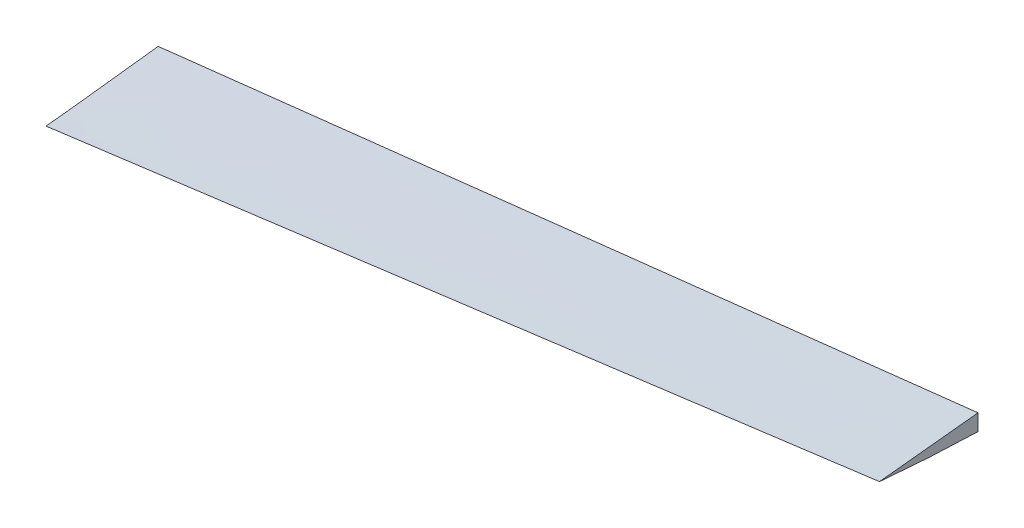
ISO-10303-21;
HEADER;
FILE_DESCRIPTION(('STEP AP214'),'2;1');
FILE_NAME('part.step','',(''),(''),'','','');
FILE_SCHEMA(('AUTOMOTIVE_DESIGN { 1 0 10303 214 1 1 1 1 }'));
ENDSEC;
DATA;
#1=APPLICATION_CONTEXT('core data for automotive mechanical design processes');
#2=APPLICATION_PROTOCOL_DEFINITION('international standard','automotive_design',2000,#1);
#3=PRODUCT_CONTEXT('',#1,'mechanical');
#4=PRODUCT('Part','Part','',(#3));
#5=PRODUCT_RELATED_PRODUCT_CATEGORY('part','',(#4));
#6=PRODUCT_DEFINITION_FORMATION('','',#4);
#7=PRODUCT_DEFINITION_CONTEXT('part definition',#1,'design');
#8=PRODUCT_DEFINITION('design','',#6,#7);
#9=PRODUCT_DEFINITION_SHAPE('','',#8);
#10=(LENGTH_UNIT() NAMED_UNIT(*) SI_UNIT(.MILLI.,.METRE.));
#11=(NAMED_UNIT(*) PLANE_ANGLE_UNIT() SI_UNIT($,.RADIAN.));
#12=(NAMED_UNIT(*) SI_UNIT($,.STERADIAN.) SOLID_ANGLE_UNIT());
#13=UNCERTAINTY_MEASURE_WITH_UNIT(LENGTH_MEASURE(1.E-05),#10,'distance_accuracy_value','');
#14=(GEOMETRIC_REPRESENTATION_CONTEXT(3) GLOBAL_UNCERTAINTY_ASSIGNED_CONTEXT((#13)) GLOBAL_UNIT_ASSIGNED_CONTEXT((#10,
#11,#12)) REPRESENTATION_CONTEXT('',''));
#15=CARTESIAN_POINT('',(0.,0.,0.));
#16=DIRECTION('',(0.,0.,1.));
#17=DIRECTION('',(1.,0.,0.));
#18=AXIS2_PLACEMENT_3D('',#15,#16,#17);
#19=CARTESIAN_POINT('',(2447.30235188464,-209.311409679221,0.));
#20=DIRECTION('',(-1.,0.,0.));
#21=DIRECTION('',(0.,0.,1.));
#22=AXIS2_PLACEMENT_3D('',#19,#20,#21);
#23=PLANE('',#22);
#24=DIRECTION('',(0.,1.,0.));
#25=VECTOR('',#24,1.);
#26=CARTESIAN_POINT('',(2447.30235188464,-209.311409679221,711.903406011324));
#27=LINE('',#26,#25);
#28=CARTESIAN_POINT('',(2447.30235188464,127.230999408886,711.903406011324));
#29=VERTEX_POINT('',#28);
#30=CARTESIAN_POINT('',(2447.30235188464,154.239299038269,711.903406011324));
#31=VERTEX_POINT('',#30);
#32=EDGE_CURVE('E93',#29,#31,#27,.T.);
#33=ORIENTED_EDGE('',*,*,#32,.T.);
#34=CARTESIAN_POINT('',(2447.30235188464,154.239299038269,711.903406011324));
#35=CARTESIAN_POINT('',(2447.30235188464,153.901181779624,715.300913346903));
#36=CARTESIAN_POINT('',(2447.30235188464,153.560697013205,718.698184748369));
#37=CARTESIAN_POINT('',(2447.30235188464,152.875208153736,725.492271074562));
#38=CARTESIAN_POINT('',(2447.30235188464,152.530204061408,728.889085999362));
#39=CARTESIAN_POINT('',(2447.30235188464,151.83589413983,735.682256193434));
#40=CARTESIAN_POINT('',(2447.30235188464,151.486588335484,739.07861146525));
#41=CARTESIAN_POINT('',(2447.30235188464,150.783887441312,745.870898805664));
#42=CARTESIAN_POINT('',(2447.30235188464,150.430492351552,749.266830874268));
#43=CARTESIAN_POINT('',(2447.30235188464,149.719890590803,756.05829659947));
#44=CARTESIAN_POINT('',(2447.30235188464,149.362683919243,759.453830256008));
#45=CARTESIAN_POINT('',(2447.30235188464,148.644763541648,766.244526482214));
#46=CARTESIAN_POINT('',(2447.30235188464,148.284049835828,769.639689051906));
#47=CARTESIAN_POINT('',(2447.30235188464,147.559439890166,776.42968748534));
#48=CARTESIAN_POINT('',(2447.30235188464,147.195543638244,779.824523347794));
#49=CARTESIAN_POINT('',(2447.30235188464,146.464928478762,786.613892000002));
#50=CARTESIAN_POINT('',(2447.30235188464,146.098209570571,790.008424789688));
#51=CARTESIAN_POINT('',(2447.30235188464,145.484995007267,795.665762302538));
#52=CARTESIAN_POINT('',(2447.30235188464,145.239171423317,797.928639918983));
#53=CARTESIAN_POINT('',(2447.30235188464,144.746585058713,802.454292305212));
#54=CARTESIAN_POINT('',(2447.30235188464,144.499822278312,804.717067075023));
#55=CARTESIAN_POINT('',(2447.30235188464,144.005499218229,809.242527221412));
#56=CARTESIAN_POINT('',(2447.30235188464,143.757938939336,811.505212598075));
#57=CARTESIAN_POINT('',(2447.30235188464,143.262210651827,816.030518986471));
#58=CARTESIAN_POINT('',(2447.30235188464,143.014042642618,818.293139998139));
#59=CARTESIAN_POINT('',(2447.30235188464,142.517605468776,822.818373235184));
#60=CARTESIAN_POINT('',(2447.30235188464,142.26933630404,825.08098546055));
#61=CARTESIAN_POINT('',(2447.30235188464,141.773257232358,829.606269170652));
#62=CARTESIAN_POINT('',(2447.30235188464,141.525447327192,831.868940655584));
#63=CARTESIAN_POINT('',(2447.30235188464,141.030956035476,836.394404059674));
#64=CARTESIAN_POINT('',(2447.30235188464,140.784274647464,838.657195978673));
#65=CARTESIAN_POINT('',(2447.30235188464,140.292814912716,843.182979270085));
#66=CARTESIAN_POINT('',(2447.30235188464,140.048036559707,845.445970641815));
#67=CARTESIAN_POINT('',(2447.30235188464,139.683052601572,848.840680292605));
#68=CARTESIAN_POINT('',(2447.30235188464,139.561755854132,849.972281217774));
#69=CARTESIAN_POINT('',(2447.30235188464,139.320272257106,852.235600408934));
#70=CARTESIAN_POINT('',(2447.30235188464,139.200085406301,853.367318674794));
#71=CARTESIAN_POINT('',(2447.30235188464,139.001026715525,855.253683424999));
#72=CARTESIAN_POINT('',(2447.30235188464,138.921736099067,856.008285705963));
#73=CARTESIAN_POINT('',(2447.30235188464,138.763962735591,857.517575577193));
#74=CARTESIAN_POINT('',(2447.30235188464,138.68547998943,858.272263167548));
#75=CARTESIAN_POINT('',(2447.30235188464,138.529448206426,859.781738039569));
#76=CARTESIAN_POINT('',(2447.30235188464,138.451899173394,860.536525321629));
#77=CARTESIAN_POINT('',(2447.30235188464,138.297971037103,862.04622383827));
#78=CARTESIAN_POINT('',(2447.30235188464,138.221591940745,862.801135073556));
#79=CARTESIAN_POINT('',(2447.30235188464,138.07038341548,864.311110545028));
#80=CARTESIAN_POINT('',(2447.30235188464,137.995553981595,865.066174780713));
#81=CARTESIAN_POINT('',(2447.30235188464,137.847824309025,866.57648470934));
#82=CARTESIAN_POINT('',(2447.30235188464,137.774924051188,867.331730400405));
#83=CARTESIAN_POINT('',(2447.30235188464,137.631513003727,868.842509611029));
#84=CARTESIAN_POINT('',(2447.30235188464,137.561002403801,869.598043148647));
#85=CARTESIAN_POINT('',(2447.30235188464,137.424111748015,871.10949336672));
#86=CARTESIAN_POINT('',(2447.30235188464,137.357731710373,871.865410048851));
#87=CARTESIAN_POINT('',(2447.30235188464,137.231052694076,873.377787656102));
#88=CARTESIAN_POINT('',(2447.30235188464,137.170754015199,874.134248606203));
#89=CARTESIAN_POINT('',(2447.30235188464,137.114474518952,874.891026670315));
#90=B_SPLINE_CURVE_WITH_KNOTS('',3,(#34,#35,#36,#37,#38,#39,#40,#41,#42,#43,#44,#45,#46,#47,#48,
#49,#50,#51,#52,#53,#54,#55,#56,#57,#58,#59,#60,#61,#62,#63,#64,#65,#66,#67,#68,#69,#70,#71,#72,
#73,#74,#75,#76,#77,#78,#79,#80,#81,#82,#83,#84,#85,#86,#87,#88,#89),.UNSPECIFIED.,.F.,.F.,(4,2,
2,2,2,2,2,2,2,2,2,2,2,2,2,2,2,2,2,2,2,2,2,2,2,2,2,4),(0.,10.2428700961824,20.4857385573688,
30.7285477466414,40.9713567699184,51.2141673313228,61.4569772600907,71.6998260802671,
81.9426771908076,88.7712492553256,95.5998194833511,102.428382969072,109.256953127467,
116.085530221921,122.914133746585,129.74272842498,136.571300586764,139.985550119495,
143.399795904441,145.676065405756,147.952337319778,150.228618519277,152.504913140212,
154.781200445441,157.057465143699,159.333910118316,161.610365132609,163.886932308512),.UNSPECIFIED.);
#91=CARTESIAN_POINT('',(2447.30235188464,137.114474518952,874.891026670315));
#92=VERTEX_POINT('',#91);
#93=EDGE_CURVE('E63',#31,#92,#90,.T.);
#94=ORIENTED_EDGE('',*,*,#93,.T.);
#95=CARTESIAN_POINT('',(2447.30235188464,137.114474518952,874.891026670315));
#96=CARTESIAN_POINT('',(2447.30235188464,136.639872891949,870.377378796616));
#97=CARTESIAN_POINT('',(2447.30235188464,136.19415341231,865.860797787376));
#98=CARTESIAN_POINT('',(2447.30235188464,135.351355932978,856.824292419796));
#99=CARTESIAN_POINT('',(2447.30235188464,134.954265052625,852.304369267224));
#100=CARTESIAN_POINT('',(2447.30235188464,134.388113551594,845.522399653365));
#101=CARTESIAN_POINT('',(2447.30235188464,134.204322814793,843.26156012022));
#102=CARTESIAN_POINT('',(2447.30235188464,133.845888350278,838.739155071906));
#103=CARTESIAN_POINT('',(2447.30235188464,133.671244614875,836.477589557347));
#104=CARTESIAN_POINT('',(2447.30235188464,133.33051342653,831.953992948197));
#105=CARTESIAN_POINT('',(2447.30235188464,133.164425308397,829.691961903571));
#106=CARTESIAN_POINT('',(2447.30235188464,132.840175326328,825.167331629552));
#107=CARTESIAN_POINT('',(2447.30235188464,132.682013464545,822.904732400004));
#108=CARTESIAN_POINT('',(2447.30235188464,132.373003457026,818.379113734275));
#109=CARTESIAN_POINT('',(2447.30235188464,132.222155059211,816.116094315279));
#110=CARTESIAN_POINT('',(2447.30235188464,131.927168725874,811.589618779598));
#111=CARTESIAN_POINT('',(2447.30235188464,131.783030789897,809.326162662943));
#112=CARTESIAN_POINT('',(2447.30235188464,131.501165052961,804.798866222598));
#113=CARTESIAN_POINT('',(2447.30235188464,131.363437210369,802.5350259015));
#114=CARTESIAN_POINT('',(2447.30235188464,131.094108814533,798.006981615386));
#115=CARTESIAN_POINT('',(2447.30235188464,130.96250826105,795.742777650384));
#116=CARTESIAN_POINT('',(2447.30235188464,130.576494237199,788.950135589921));
#117=CARTESIAN_POINT('',(2447.30235188464,130.330839277449,784.421197592704));
#118=CARTESIAN_POINT('',(2447.30235188464,129.860592542894,775.361990784688));
#119=CARTESIAN_POINT('',(2447.30235188464,129.636001898575,770.831721915537));
#120=CARTESIAN_POINT('',(2447.30235188464,129.205587132529,761.76995109744));
#121=CARTESIAN_POINT('',(2447.30235188464,128.999764435091,757.238449081042));
#122=CARTESIAN_POINT('',(2447.30235188464,128.60462932428,748.174310782504));
#123=CARTESIAN_POINT('',(2447.30235188464,128.415318428576,743.641674434421));
#124=CARTESIAN_POINT('',(2447.30235188464,128.051873882362,734.575324607503));
#125=CARTESIAN_POINT('',(2447.30235188464,127.87774180532,730.041611065734));
#126=CARTESIAN_POINT('',(2447.30235188464,127.543818128726,720.973142152714));
#127=CARTESIAN_POINT('',(2447.30235188464,127.384028152814,716.438386721626));
#128=CARTESIAN_POINT('',(2447.30235188464,127.230999408886,711.903406011324));
#129=B_SPLINE_CURVE_WITH_KNOTS('',3,(#95,#96,#97,#98,#99,#100,#101,#102,#103,#104,#105,#106,
#107,#108,#109,#110,#111,#112,#113,#114,#115,#116,#117,#118,#119,#120,#121,#122,#123,#124,#125,
#126,#127,#128),.UNSPECIFIED.,.F.,.F.,(4,2,2,2,2,2,2,2,2,2,2,2,2,2,2,2,4),(0.,13.6153577778901,
27.2271013061145,34.0319834304496,40.8368598351166,47.6412063649103,54.4455547418496,
61.2496684215841,68.0537816398139,74.8578506586981,81.6619194116441,95.2686450199802,
108.876100460938,122.484587706083,136.094324449355,149.705470332978,163.318155168481),.UNSPECIFIED.);
#130=EDGE_CURVE('E11',#92,#29,#129,.T.);
#131=ORIENTED_EDGE('',*,*,#130,.T.);
#132=EDGE_LOOP('',(#33,#94,#131));
#133=FACE_BOUND('',#132,.T.);
#134=ADVANCED_FACE('F40',(#133),#23,.F.);
#135=CARTESIAN_POINT('',(1114.11611207478,-209.311409679221,0.));
#136=DIRECTION('',(1.,0.,0.));
#137=DIRECTION('',(0.,0.,-1.));
#138=AXIS2_PLACEMENT_3D('',#135,#136,#137);
#139=PLANE('',#138);
#140=CARTESIAN_POINT('',(1114.11611207478,-8.63764988127563,734.977783238803));
#141=CARTESIAN_POINT('',(1114.11611207478,-8.45957680059779,740.140867407803));
#142=CARTESIAN_POINT('',(1114.11611207478,-8.27384156909683,745.303690989605));
#143=CARTESIAN_POINT('',(1114.11611207478,-7.88603952665465,755.628147128611));
#144=CARTESIAN_POINT('',(1114.11611207478,-7.68397454091832,760.789779754435));
#145=CARTESIAN_POINT('',(1114.11611207478,-7.2624879328826,771.111809893384));
#146=CARTESIAN_POINT('',(1114.11611207478,-7.04306808444751,776.272207478804));
#147=CARTESIAN_POINT('',(1114.11611207478,-6.58574496202071,786.591718494241));
#148=CARTESIAN_POINT('',(1114.11611207478,-6.34784336094807,791.750831998178));
#149=CARTESIAN_POINT('',(1114.11611207478,-5.85090350628906,802.067657300268));
#150=CARTESIAN_POINT('',(1114.11611207478,-5.59186683482196,807.225369174398));
#151=CARTESIAN_POINT('',(1114.11611207478,-5.05003008571934,817.539277400215));
#152=CARTESIAN_POINT('',(1114.11611207478,-4.76723126801575,822.695473817727));
#153=CARTESIAN_POINT('',(1114.11611207478,-4.32321863057361,830.428891671589));
#154=CARTESIAN_POINT('',(1114.11611207478,-4.17190373691903,833.006683849249));
#155=CARTESIAN_POINT('',(1114.11611207478,-3.86233762434715,838.161852645245));
#156=CARTESIAN_POINT('',(1114.11611207478,-3.70408640493553,840.739229263551));
#157=CARTESIAN_POINT('',(1114.11611207478,-3.38034661771321,845.893543775042));
#158=CARTESIAN_POINT('',(1114.11611207478,-3.21485800612087,848.470481665478));
#159=CARTESIAN_POINT('',(1114.11611207478,-2.87617527097871,853.623851621502));
#160=CARTESIAN_POINT('',(1114.11611207478,-2.70298114757655,856.200283687099));
#161=CARTESIAN_POINT('',(1114.11611207478,-2.34822180972922,861.352659341887));
#162=CARTESIAN_POINT('',(1114.11611207478,-2.16665631344067,863.928602911696));
#163=CARTESIAN_POINT('',(1114.11611207478,-1.79454106721705,869.079841452327));
#164=CARTESIAN_POINT('',(1114.11611207478,-1.60399131849819,871.655136423237));
#165=CARTESIAN_POINT('',(1114.11611207478,-1.21324637770925,876.805195223314));
#166=CARTESIAN_POINT('',(1114.11611207478,-1.01305044210288,879.379958996125));
#167=CARTESIAN_POINT('',(1114.11611207478,-0.602452213075745,884.528675225407));
#168=CARTESIAN_POINT('',(1114.11611207478,-0.392049912883171,887.102627681341));
#169=CARTESIAN_POINT('',(1114.11611207478,0.0399053870041297,892.249980592457));
#170=CARTESIAN_POINT('',(1114.11611207478,0.261460025855485,894.823380910338));
#171=CARTESIAN_POINT('',(1114.11611207478,0.716924397678878,899.969084353498));
#172=CARTESIAN_POINT('',(1114.11611207478,0.950834105208194,902.541387481027));
#173=CARTESIAN_POINT('',(1114.11611207478,1.43224495779536,907.685393098714));
#174=CARTESIAN_POINT('',(1114.11611207478,1.67974958885108,910.257095263405));
#175=CARTESIAN_POINT('',(1114.11611207478,2.18948396280929,915.399057131923));
#176=CARTESIAN_POINT('',(1114.11611207478,2.45171381019733,917.969316825384));
#177=CARTESIAN_POINT('',(1114.11611207478,2.72189887523852,920.538747710713));
#178=B_SPLINE_CURVE_WITH_KNOTS('',3,(#140,#141,#142,#143,#144,#145,#146,#147,#148,#149,#150,
#151,#152,#153,#154,#155,#156,#157,#158,#159,#160,#161,#162,#163,#164,#165,#166,#167,#168,#169,
#170,#171,#172,#173,#174,#175,#176,#177),.UNSPECIFIED.,.F.,.F.,(4,2,2,2,2,2,2,2,2,2,2,2,2,2,2,2,
2,2,4),(0.,15.4984621085891,30.995194316797,46.4903446245951,61.9840939831939,77.476684580151,
92.9684542366647,100.715134737937,108.46181579128,116.208543713605,123.955271487474,
131.702260265196,139.449247994211,147.196833825895,154.944424798089,162.693157845461,
170.441874936532,178.192588307248,185.943356681569),.UNSPECIFIED.);
#179=CARTESIAN_POINT('',(1114.11611207478,-8.63764988127572,734.977783238803));
#180=VERTEX_POINT('',#179);
#181=CARTESIAN_POINT('',(1114.11611207478,2.72189887523844,920.538747710712));
#182=VERTEX_POINT('',#181);
#183=EDGE_CURVE('E56',#180,#182,#178,.T.);
#184=ORIENTED_EDGE('',*,*,#183,.T.);
#185=CARTESIAN_POINT('',(1114.11611207478,2.72189887523844,920.538747710712));
#186=CARTESIAN_POINT('',(1114.11611207478,2.78312712053246,919.675808987865));
#187=CARTESIAN_POINT('',(1114.11611207478,2.84833933481407,918.813163786098));
#188=CARTESIAN_POINT('',(1114.11611207478,2.98550145564108,917.08845710322));
#189=CARTESIAN_POINT('',(1114.11611207478,3.0574509777439,916.226395591626));
#190=CARTESIAN_POINT('',(1114.11611207478,3.206863927746,914.502763830938));
#191=CARTESIAN_POINT('',(1114.11611207478,3.28432729630843,913.641193576657));
#192=CARTESIAN_POINT('',(1114.11611207478,3.44354508594008,911.918514037923));
#193=CARTESIAN_POINT('',(1114.11611207478,3.5252991962434,911.057404724636));
#194=CARTESIAN_POINT('',(1114.11611207478,3.65024979635369,909.765960707129));
#195=CARTESIAN_POINT('',(1114.11611207478,3.69228686797917,909.335513046527));
#196=CARTESIAN_POINT('',(1114.11611207478,3.77697796287327,908.474678399423));
#197=CARTESIAN_POINT('',(1114.11611207478,3.81963198611025,908.044291412918));
#198=CARTESIAN_POINT('',(1114.11611207478,3.94845911654393,906.753213384666));
#199=CARTESIAN_POINT('',(1114.11611207478,4.03549696341548,905.892608581312));
#200=CARTESIAN_POINT('',(1114.11611207478,4.25562058753378,903.741650547325));
#201=CARTESIAN_POINT('',(1114.11611207478,4.38998476781105,902.451428195505));
#202=CARTESIAN_POINT('',(1114.11611207478,4.66245055930781,899.871386143646));
#203=CARTESIAN_POINT('',(1114.11611207478,4.80055215097003,898.581566441537));
#204=CARTESIAN_POINT('',(1114.11611207478,5.07957147422909,896.002203352579));
#205=CARTESIAN_POINT('',(1114.11611207478,5.22048926792021,894.712659972459));
#206=CARTESIAN_POINT('',(1114.11611207478,5.50467808657557,892.133830833562));
#207=CARTESIAN_POINT('',(1114.11611207478,5.64794911496829,890.844545075162));
#208=CARTESIAN_POINT('',(1114.11611207478,5.93654966160471,888.266227115696));
#209=CARTESIAN_POINT('',(1114.11611207478,6.08187914356752,886.977194910565));
#210=CARTESIAN_POINT('',(1114.11611207478,6.37426598785064,884.399327207519));
#211=CARTESIAN_POINT('',(1114.11611207478,6.52132334940311,883.110491709518));
#212=CARTESIAN_POINT('',(1114.11611207478,6.81685376436571,880.53299298608));
#213=CARTESIAN_POINT('',(1114.11611207478,6.96532680711073,879.24432975942));
#214=CARTESIAN_POINT('',(1114.11611207478,7.26334587121772,876.667127281831));
#215=CARTESIAN_POINT('',(1114.11611207478,7.41289189272755,875.37858803092));
#216=CARTESIAN_POINT('',(1114.11611207478,7.71289160211865,872.801600338109));
#217=CARTESIAN_POINT('',(1114.11611207478,7.86334530031796,871.51315189741));
#218=CARTESIAN_POINT('',(1114.11611207478,8.16509636867343,868.936353920824));
#219=CARTESIAN_POINT('',(1114.11611207478,8.31639373877555,867.64800438493));
#220=CARTESIAN_POINT('',(1114.11611207478,8.77142341020872,863.783084506679));
#221=CARTESIAN_POINT('',(1114.11611207478,9.07629267801341,861.206647996305));
#222=CARTESIAN_POINT('',(1114.11611207478,9.68842836914048,856.054040788956));
#223=CARTESIAN_POINT('',(1114.11611207478,9.99569481011644,853.477870094081));
#224=CARTESIAN_POINT('',(1114.11611207478,10.6119877472548,848.325740812713));
#225=CARTESIAN_POINT('',(1114.11611207478,10.9210142424399,845.749782226103));
#226=CARTESIAN_POINT('',(1114.11611207478,11.5402074766053,840.597994569352));
#227=CARTESIAN_POINT('',(1114.11611207478,11.8503742189122,838.02216549961));
#228=CARTESIAN_POINT('',(1114.11611207478,12.4712138713706,832.87056801963));
#229=CARTESIAN_POINT('',(1114.11611207478,12.7818867815954,830.2947996094));
#230=CARTESIAN_POINT('',(1114.11611207478,13.4031739716276,825.14335068187));
#231=CARTESIAN_POINT('',(1114.11611207478,13.7137882531552,822.567670164778));
#232=CARTESIAN_POINT('',(1114.11611207478,14.3348524199862,817.416289423255));
#233=CARTESIAN_POINT('',(1114.11611207478,14.6453023052965,814.840589198825));
#234=CARTESIAN_POINT('',(1114.11611207478,15.576169969008,807.113408571135));
#235=CARTESIAN_POINT('',(1114.11611207478,16.1961031550658,801.961869751738));
#236=CARTESIAN_POINT('',(1114.11611207478,17.4335008948234,791.658474294146));
#237=CARTESIAN_POINT('',(1114.11611207478,18.0509654385243,786.506617654749));
#238=CARTESIAN_POINT('',(1114.11611207478,19.2822607027744,776.20244764566));
#239=CARTESIAN_POINT('',(1114.11611207478,19.8960914078237,771.050134274115));
#240=CARTESIAN_POINT('',(1114.11611207478,21.1189616871359,760.744912575504));
#241=CARTESIAN_POINT('',(1114.11611207478,21.7280012376457,755.592004245617));
#242=CARTESIAN_POINT('',(1114.11611207478,22.9401822307826,745.285461430918));
#243=CARTESIAN_POINT('',(1114.11611207478,23.5433236364968,740.131826941766));
#244=CARTESIAN_POINT('',(1114.11611207478,24.1429602001476,734.977783238803));
#245=B_SPLINE_CURVE_WITH_KNOTS('',3,(#185,#186,#187,#188,#189,#190,#191,#192,#193,#194,#195,
#196,#197,#198,#199,#200,#201,#202,#203,#204,#205,#206,#207,#208,#209,#210,#211,#212,#213,#214,
#215,#216,#217,#218,#219,#220,#221,#222,#223,#224,#225,#226,#227,#228,#229,#230,#231,#232,#233,
#234,#235,#236,#237,#238,#239,#240,#241,#242,#243,#244),.UNSPECIFIED.,.F.,.F.,(4,2,2,2,2,2,2,2,
2,2,2,2,2,2,2,2,2,2,2,2,2,2,2,2,2,2,2,2,2,4),(0.,2.59529973633038,5.19045147045508,
7.7855752812601,10.3805113935087,11.677997420431,12.9754833808229,15.5704652695947,
19.4620575174721,23.3536294052083,27.2452871928526,31.1369506508425,35.0285456022008,
38.9201388242919,42.8117027520131,46.7032672160182,50.5948760011966,54.4864845371814,
62.2697170203864,70.0530068761307,77.83629241018,85.6196006692297,93.402910057382,
101.185936599673,108.96896281175,124.535080319823,140.101260811804,155.667507652713,
171.233831617983,186.800252941338),.UNSPECIFIED.);
#246=CARTESIAN_POINT('',(1114.11611207478,24.1429602001476,734.977783238803));
#247=VERTEX_POINT('',#246);
#248=EDGE_CURVE('E96',#182,#247,#245,.T.);
#249=ORIENTED_EDGE('',*,*,#248,.T.);
#250=DIRECTION('',(0.,1.,0.));
#251=VECTOR('',#250,1.);
#252=CARTESIAN_POINT('',(1114.11611207478,-209.311409679221,734.977783238803));
#253=LINE('',#252,#251);
#254=EDGE_CURVE('E91',#180,#247,#253,.T.);
#255=ORIENTED_EDGE('',*,*,#254,.F.);
#256=EDGE_LOOP('',(#184,#249,#255));
#257=FACE_BOUND('',#256,.T.);
#258=ADVANCED_FACE('F95',(#257),#139,.F.);
#259=CARTESIAN_POINT('',(13.0506003402666,-209.311409679221,754.034686326515));
#260=DIRECTION('',(0.0173051005765728,0.,0.999850255535315));
#261=DIRECTION('',(0.999850255535315,0.,-0.0173051005765728));
#262=AXIS2_PLACEMENT_3D('',#259,#260,#261);
#263=PLANE('',#262);
#264=ORIENTED_EDGE('',*,*,#254,.T.);
#265=CARTESIAN_POINT('',(1114.11611207478,24.1429602001476,734.977783238803));
#266=CARTESIAN_POINT('',(1225.21221374929,35.0124748282119,733.054966094436));
#267=CARTESIAN_POINT('',(1336.30891800194,45.875830415512,731.132138520833));
#268=CARTESIAN_POINT('',(1558.50365655141,67.588905794208,727.28646035363));
#269=CARTESIAN_POINT('',(1669.6016908482,78.4386255858511,725.363609760032));
#270=CARTESIAN_POINT('',(1891.79922606862,100.123112801258,721.517883188909));
#271=CARTESIAN_POINT('',(2002.89872699235,110.95788022399,719.595007211383));
#272=CARTESIAN_POINT('',(2225.09931701216,132.611133259769,715.749227768733));
#273=CARTESIAN_POINT('',(2336.20040610826,143.429618872521,713.826324303608));
#274=CARTESIAN_POINT('',(2447.30235188464,154.239299038269,711.903406011324));
#275=B_SPLINE_CURVE_WITH_KNOTS('',3,(#265,#266,#267,#268,#269,#270,#271,#272,#273,#274),
.UNSPECIFIED.,.F.,.F.,(4,2,2,2,4),(0.,334.929375356324,669.858744644065,1004.78813705123,
1339.71753552698),.UNSPECIFIED.);
#276=EDGE_CURVE('E67',#247,#31,#275,.T.);
#277=ORIENTED_EDGE('',*,*,#276,.T.);
#278=ORIENTED_EDGE('',*,*,#32,.F.);
#279=CARTESIAN_POINT('',(2447.30235188464,127.230999408886,711.903406011324));
#280=CARTESIAN_POINT('',(2328.87074131155,115.161182425581,713.953183886628));
#281=CARTESIAN_POINT('',(2210.43912679047,103.091404192346,716.002961830262));
#282=CARTESIAN_POINT('',(2032.79169971175,84.9867888348265,719.077628837394));
#283=CARTESIAN_POINT('',(1973.57588980266,78.9519257143756,720.102517855051));
#284=CARTESIAN_POINT('',(1795.92845758303,60.8473608159958,723.17718495116));
#285=CARTESIAN_POINT('',(1677.49683278015,48.7776835010403,725.226963072748));
#286=CARTESIAN_POINT('',(1499.84939112303,30.6732112340808,728.301630332198));
#287=CARTESIAN_POINT('',(1440.6335764952,24.63839442934,729.326519431526));
#288=CARTESIAN_POINT('',(1292.31721301729,9.52315784763269,731.893533414798));
#289=CARTESIAN_POINT('',(1203.21666327755,0.442746803109665,733.43565831414));
#290=CARTESIAN_POINT('',(1114.11611207477,-8.63764988127565,734.977783238803));
#291=B_SPLINE_CURVE_WITH_KNOTS('',3,(#279,#280,#281,#282,#283,#284,#285,#286,#287,#288,#289,
#290),.UNSPECIFIED.,.F.,.F.,(4,2,2,2,2,4),(0.,357.18812422666,535.782186339983,892.970310566639,
1071.56437267996,1340.29036658603),.UNSPECIFIED.);
#292=EDGE_CURVE('E83',#29,#180,#291,.T.);
#293=ORIENTED_EDGE('',*,*,#292,.T.);
#294=EDGE_LOOP('',(#264,#277,#278,#293));
#295=FACE_BOUND('',#294,.T.);
#296=ADVANCED_FACE('F90',(#295),#263,.F.);
#297=CARTESIAN_POINT('',(940.,-9.56504290397643,223.608063618976));
#298=CARTESIAN_POINT('',(3360.,233.06816214663,316.471394972551));
#299=CARTESIAN_POINT('',(940.,-8.02027267485098,223.497813242443));
#300=CARTESIAN_POINT('',(3360.,233.496407991043,316.470996572016));
#301=CARTESIAN_POINT('',(940.,-4.47959626742021,223.565804357872));
#302=CARTESIAN_POINT('',(3360.,234.458537813297,316.589259715092));
#303=CARTESIAN_POINT('',(940.000000000001,1.44669236690267,225.134502057212));
#304=CARTESIAN_POINT('',(3360.,236.066287107498,317.232072138334));
#305=CARTESIAN_POINT('',(940.,6.82643414570751,228.576352450416));
#306=CARTESIAN_POINT('',(3360.,237.667267163745,318.437261276939));
#307=CARTESIAN_POINT('',(939.999999999999,11.7404895707824,233.544787952069));
#308=CARTESIAN_POINT('',(3360.,239.358283762587,320.270295635811));
#309=CARTESIAN_POINT('',(940.000000000004,15.5733875232566,238.995317221905));
#310=CARTESIAN_POINT('',(3360.,240.893793376099,322.461115807963));
#311=CARTESIAN_POINT('',(939.999999999993,20.0245016339786,247.231373002064));
#312=CARTESIAN_POINT('',(3360.,242.932692406803,326.130376119627));
#313=CARTESIAN_POINT('',(940.,22.5438468459346,253.474702898048));
#314=CARTESIAN_POINT('',(3360.,244.270828890109,329.261763328095));
#315=CARTESIAN_POINT('',(940.,25.9808918699352,262.872038456949));
#316=CARTESIAN_POINT('',(3360.,246.128552322601,334.244386981412));
#317=CARTESIAN_POINT('',(940.,27.8104633982039,268.388131093572));
#318=CARTESIAN_POINT('',(3360.,247.110816021893,337.363556728091));
#319=CARTESIAN_POINT('',(940.,30.7153223458365,278.678756285474));
#320=CARTESIAN_POINT('',(3360.,248.719392241408,343.255978527393));
#321=CARTESIAN_POINT('',(940.000000000003,33.138795242613,288.836415521017));
#322=CARTESIAN_POINT('',(3360.,250.116079008917,349.135834544944));
#323=CARTESIAN_POINT('',(940.000000000001,35.3471243918836,303.677135629769));
#324=CARTESIAN_POINT('',(3360.,251.704084177296,357.988674236495));
#325=CARTESIAN_POINT('',(939.999999999995,36.6183946800392,317.892798928758));
#326=CARTESIAN_POINT('',(3360.,252.885869741036,366.834831102443));
#327=CARTESIAN_POINT('',(940.000000000002,37.3940738106048,331.595074097015));
#328=CARTESIAN_POINT('',(3360.,253.793628857933,375.733342377245));
#329=CARTESIAN_POINT('',(940.000000000003,37.9293533689735,348.066452763089));
#330=CARTESIAN_POINT('',(3360.,254.668331292051,386.911859580299));
#331=CARTESIAN_POINT('',(939.999999999999,38.0502423959914,372.436117347362));
#332=CARTESIAN_POINT('',(3360.,255.645862138178,404.519070337089));
#333=CARTESIAN_POINT('',(940.000000000003,37.3327630580721,402.641516215683));
#334=CARTESIAN_POINT('',(3360.,256.273732028299,428.269697011403));
#335=CARTESIAN_POINT('',(939.999999999999,35.4137070709717,444.681451692998));
#336=CARTESIAN_POINT('',(3360.,256.315756402199,463.872630004857));
#337=CARTESIAN_POINT('',(939.999999999997,31.6478396439324,500.620148874405));
#338=CARTESIAN_POINT('',(3360.,255.056609378194,514.904852075));
#339=CARTESIAN_POINT('',(940.000000000002,25.8786893106136,565.958031444988));
#340=CARTESIAN_POINT('',(3360.,251.773063995229,578.18343803737));
#341=CARTESIAN_POINT('',(940.000000000002,17.3085207564867,650.079015738308));
#342=CARTESIAN_POINT('',(3360.,246.084668733733,659.522033806449));
#343=CARTESIAN_POINT('',(940.000000000008,7.40540733564246,736.461203085278));
#344=CARTESIAN_POINT('',(3360.,239.250861372892,737.909847676662));
#345=CARTESIAN_POINT('',(940.000000000001,-2.68867718335003,819.245433400626));
#346=CARTESIAN_POINT('',(3360.,233.53799144423,796.976654523425));
#347=CARTESIAN_POINT('',(939.999999999999,-8.94635525197262,870.733978391583));
#348=CARTESIAN_POINT('',(3360.,230.930435741034,823.76987020457));
#349=CARTESIAN_POINT('',(940.000000000001,-12.1203359875502,898.425041911615));
#350=CARTESIAN_POINT('',(3360.,229.89104364015,834.858154549589));
#351=CARTESIAN_POINT('',(940.,-13.7508929308094,913.830187168131));
#352=CARTESIAN_POINT('',(3360.,229.421550641686,840.072160833978));
#353=CARTESIAN_POINT('',(940.,-14.5374621759064,922.36388880254));
#354=CARTESIAN_POINT('',(3360.,229.209954317924,842.544297697433));
#355=CARTESIAN_POINT('',(940.,-14.8299720217607,926.500408186417));
#356=CARTESIAN_POINT('',(3360.,229.119465308292,843.640653398131));
#357=B_SPLINE_SURFACE_WITH_KNOTS('',3,1,((#297,#298),(#299,#300),(#301,#302),(#303,#304),(#305,
#306),(#307,#308),(#309,#310),(#311,#312),(#313,#314),(#315,#316),(#317,#318),(#319,#320),(#321,
#322),(#323,#324),(#325,#326),(#327,#328),(#329,#330),(#331,#332),(#333,#334),(#335,#336),(#337,
#338),(#339,#340),(#341,#342),(#343,#344),(#345,#346),(#347,#348),(#349,#350),(#351,#352),(#353,
#354),(#355,#356)),.UNSPECIFIED.,.F.,.F.,.F.,(4,1,1,1,1,1,1,2,1,1,1,1,1,1,1,1,1,1,1,1,1,1,1,1,1,
1,4),(2,2),(0.,0.006410597040166,0.0145892274152385,0.0251414710265059,0.0325314048408687,
0.0434282834039079,0.0526341051839309,0.0712473531888315,0.0940570235538322,0.0952868127871718,
0.115512955845202,0.137248293798024,0.157352167069718,0.174582367361767,0.194057023553832,
0.225576732325112,0.275447871083008,0.319119109874962,0.399782931370474,0.507524346583521,
0.590635284325762,0.749813465416931,0.86745200704032,0.935872620431236,0.964526277833232,
0.982833591965527,1.),(0.,1.),.UNSPECIFIED.);
#358=DIRECTION('',(0.994380668982466,0.100239092847171,-0.0340471646273134));
#359=VECTOR('',#358,1.);
#360=CARTESIAN_POINT('',(2150.,107.144746643266,885.070530792274));
#361=LINE('',#360,#359);
#362=EDGE_CURVE('E84',#182,#92,#361,.T.);
#363=ORIENTED_EDGE('',*,*,#93,.F.);
#364=ORIENTED_EDGE('',*,*,#276,.F.);
#365=ORIENTED_EDGE('',*,*,#248,.F.);
#366=ORIENTED_EDGE('',*,*,#362,.T.);
#367=EDGE_LOOP('',(#363,#364,#365,#366));
#368=FACE_BOUND('',#367,.T.);
#369=ADVANCED_FACE('F112',(#368),#357,.T.);
#370=CARTESIAN_POINT('',(940.,-14.8299720217606,926.500408186417));
#371=CARTESIAN_POINT('',(3360.,229.119465308292,843.640653398132));
#372=CARTESIAN_POINT('',(940.,-15.8932587268398,916.388631923073));
#373=CARTESIAN_POINT('',(3360.,228.322078598752,836.057566010961));
#374=CARTESIAN_POINT('',(940.,-17.0001137799086,904.498563968127));
#375=CARTESIAN_POINT('',(3360.,227.494707966312,827.140593494319));
#376=CARTESIAN_POINT('',(939.999999999999,-18.9613196522661,880.875095925324));
#377=CARTESIAN_POINT('',(3360.,226.02568124722,809.424775119013));
#378=CARTESIAN_POINT('',(939.999999999999,-20.0324396141344,866.085351309633));
#379=CARTESIAN_POINT('',(3360.,225.224464219777,798.333371553742));
#380=CARTESIAN_POINT('',(939.999999999998,-22.3336828550972,830.647110753391));
#381=CARTESIAN_POINT('',(3360.00000000001,223.496678075171,771.757649537834));
#382=CARTESIAN_POINT('',(939.999999999999,-23.7924488767552,802.527278503484));
#383=CARTESIAN_POINT('',(3360.00000000001,222.397089675601,750.670415442586));
#384=CARTESIAN_POINT('',(940.,-25.8173053060718,755.14906946034));
#385=CARTESIAN_POINT('',(3360.00000000001,220.881866304308,715.139796911045));
#386=CARTESIAN_POINT('',(940.,-27.0159327941927,720.562956803205));
#387=CARTESIAN_POINT('',(3360.,219.980734269206,689.202932003744));
#388=CARTESIAN_POINT('',(940.,-28.3436125266727,671.680999888286));
#389=CARTESIAN_POINT('',(3360.,218.984825915022,652.544899226358));
#390=CARTESIAN_POINT('',(939.999999999999,-29.1783691040758,631.538422450321));
#391=CARTESIAN_POINT('',(3360.,218.354733797809,622.441190860024));
#392=CARTESIAN_POINT('',(939.999999999998,-30.3078641830483,557.878796797661));
#393=CARTESIAN_POINT('',(3360.,217.518554674968,567.201771469934));
#394=CARTESIAN_POINT('',(939.999999999997,-30.6464596896065,497.178694517654));
#395=CARTESIAN_POINT('',(3360.,217.257034196145,521.681269530901));
#396=CARTESIAN_POINT('',(940.,-30.4741904655422,436.430894156495));
#397=CARTESIAN_POINT('',(3360.,217.391445183068,476.125102186916));
#398=CARTESIAN_POINT('',(940.000000000002,-30.3432937833002,415.080038305095));
#399=CARTESIAN_POINT('',(3360.,217.489033531404,460.113571927188));
#400=CARTESIAN_POINT('',(940.000000000002,-30.0570749722948,385.108987674022));
#401=CARTESIAN_POINT('',(3360.,217.697418828004,437.63734356756));
#402=CARTESIAN_POINT('',(940.,-29.7974679406378,366.155924276402));
#403=CARTESIAN_POINT('',(3360.,217.892859219719,423.423974124328));
#404=CARTESIAN_POINT('',(940.,-29.3497715866658,343.670027836794));
#405=CARTESIAN_POINT('',(3360.,218.230916399885,406.561437342048));
#406=CARTESIAN_POINT('',(939.999999999999,-29.1474961235818,335.125071492125));
#407=CARTESIAN_POINT('',(3360.,218.38151361521,400.153386173157));
#408=CARTESIAN_POINT('',(939.999999999999,-28.7923298332118,323.598923194741));
#409=CARTESIAN_POINT('',(3359.99999999999,218.642517052059,391.509266490726));
#410=CARTESIAN_POINT('',(939.999999999998,-28.560060498694,316.93339756157));
#411=CARTESIAN_POINT('',(3359.99999999999,218.814080179768,386.510393714428));
#412=CARTESIAN_POINT('',(940.000000000001,-28.2419819838638,309.843529655706));
#413=CARTESIAN_POINT('',(3360.,219.06205935287,381.194234183364));
#414=CARTESIAN_POINT('',(940.000000000001,-28.0523645662856,306.574629339644));
#415=CARTESIAN_POINT('',(3360.,219.197348429622,378.742344655634));
#416=CARTESIAN_POINT('',(940.000000000001,-27.8060341079957,302.544417825675));
#417=CARTESIAN_POINT('',(3360.00000000001,219.37130677866,375.719212463484));
#418=CARTESIAN_POINT('',(939.999999999999,-27.439759476821,297.529578500427));
#419=CARTESIAN_POINT('',(3360.,219.648497755199,371.958819962234));
#420=CARTESIAN_POINT('',(939.999999999999,-26.6522670133843,288.379804389478));
#421=CARTESIAN_POINT('',(3360.,220.258647593337,365.098716893707));
#422=CARTESIAN_POINT('',(940.000000000001,-25.7647492474548,279.550505275756));
#423=CARTESIAN_POINT('',(3360.,220.921673131539,358.477793203704));
#424=CARTESIAN_POINT('',(940.000000000001,-24.9620060739258,272.550133465626));
#425=CARTESIAN_POINT('',(3360.,221.513071677618,353.226076383093));
#426=CARTESIAN_POINT('',(940.000000000001,-24.1130893892486,265.455525260418));
#427=CARTESIAN_POINT('',(3360.,222.159067449965,347.906121258696));
#428=CARTESIAN_POINT('',(940.000000000001,-23.4791848057045,260.771315472134));
#429=CARTESIAN_POINT('',(3360.,222.631467496281,344.392425454581));
#430=CARTESIAN_POINT('',(940.,-22.0755057940592,251.813797322593));
#431=CARTESIAN_POINT('',(3360.,223.692161681318,337.676768904303));
#432=CARTESIAN_POINT('',(939.999999999999,-21.0870729356147,246.381740663081));
#433=CARTESIAN_POINT('',(3360.00000000001,224.437740009327,333.603445098729));
#434=CARTESIAN_POINT('',(939.999999999999,-19.6452394563345,240.423370306185));
#435=CARTESIAN_POINT('',(3360.,225.528410637678,329.13802537888));
#436=CARTESIAN_POINT('',(939.999999999999,-18.9099252504872,237.682529783245));
#437=CARTESIAN_POINT('',(3360.,226.080325817828,327.082052477647));
#438=CARTESIAN_POINT('',(940.,-18.0516611436219,234.900686387334));
#439=CARTESIAN_POINT('',(3360.,226.729240567138,324.997724312384));
#440=CARTESIAN_POINT('',(940.,-17.2788054453614,232.752755557766));
#441=CARTESIAN_POINT('',(3360.00000000001,227.310185316446,323.387272455606));
#442=CARTESIAN_POINT('',(940.,-16.414922368223,230.613861559096));
#443=CARTESIAN_POINT('',(3360.00000000001,227.9635490934,321.787682324484));
#444=CARTESIAN_POINT('',(940.,-15.7504998712154,229.228731936651));
#445=CARTESIAN_POINT('',(3360.,228.461747569289,320.748935254075));
#446=CARTESIAN_POINT('',(939.999999999999,-14.7599674749285,227.495540597207));
#447=CARTESIAN_POINT('',(3360.,229.203792778444,319.449367623387));
#448=CARTESIAN_POINT('',(939.999999999999,-14.1587121972313,226.581023084634));
#449=CARTESIAN_POINT('',(3360.,229.653727342329,318.763402552757));
#450=CARTESIAN_POINT('',(939.999999999999,-13.0377779219564,225.311005523702));
#451=CARTESIAN_POINT('',(3360.,230.490584935732,317.794444067586));
#452=CARTESIAN_POINT('',(940.,-12.2429079692271,224.589787557199));
#453=CARTESIAN_POINT('',(3360.,231.082317493923,317.246922343787));
#454=CARTESIAN_POINT('',(940.,-10.955968894628,223.867436203481));
#455=CARTESIAN_POINT('',(3360.,232.024274968376,316.693334255142));
#456=CARTESIAN_POINT('',(940.,-10.1288468833064,223.639039661241));
#457=CARTESIAN_POINT('',(3360.,232.645113386948,316.507628005983));
#458=CARTESIAN_POINT('',(940.,-9.5650429039759,223.608063618976));
#459=CARTESIAN_POINT('',(3360.,233.068162146631,316.471394972551));
#460=B_SPLINE_SURFACE_WITH_KNOTS('',3,1,((#370,#371),(#372,#373),(#374,#375),(#376,#377),(#378,
#379),(#380,#381),(#382,#383),(#384,#385),(#386,#387),(#388,#389),(#390,#391),(#392,#393),(#394,
#395),(#396,#397),(#398,#399),(#400,#401),(#402,#403),(#404,#405),(#406,#407),(#408,#409),(#410,
#411),(#412,#413),(#414,#415),(#416,#417),(#418,#419),(#420,#421),(#422,#423),(#424,#425),(#426,
#427),(#428,#429),(#430,#431),(#432,#433),(#434,#435),(#436,#437),(#438,#439),(#440,#441),(#442,
#443),(#444,#445),(#446,#447),(#448,#449),(#450,#451),(#452,#453),(#454,#455),(#456,#457),(#458,
#459)),.UNSPECIFIED.,.F.,.F.,.F.,(4,1,1,1,1,1,1,1,1,1,1,1,1,1,1,1,1,1,1,1,1,2,1,1,1,2,1,1,1,1,1,
1,1,1,1,1,1,1,1,1,4),(2,2),(0.,0.0430984414381896,0.0506157510893491,0.100479794288408,
0.10595230945046,0.201149410798296,0.219829325961069,0.306963456382857,0.347840016938749,
0.427108630931488,0.477156658269096,0.660107141138051,0.684403332457358,0.734657294440846,
0.750611442383879,0.811451545949787,0.815003124434654,0.845944212293286,0.84768208293399,
0.863884050145848,0.874215202686331,0.877764033582396,0.891330957802499,0.899076556737716,
0.916691643033932,0.928943609425639,0.946979805856867,0.948980378273081,0.967367658550568,
0.970369336034846,0.974966043779617,0.979396155609305,0.982707817287566,0.98464033450793,
0.989162794169177,0.989210425788685,0.993094201561276,0.993781508728646,0.99639653415333,
0.997610586858735,1.),(0.,1.),.UNSPECIFIED.);
#461=ORIENTED_EDGE('',*,*,#130,.F.);
#462=ORIENTED_EDGE('',*,*,#362,.F.);
#463=ORIENTED_EDGE('',*,*,#183,.F.);
#464=ORIENTED_EDGE('',*,*,#292,.F.);
#465=EDGE_LOOP('',(#461,#462,#463,#464));
#466=FACE_BOUND('',#465,.T.);
#467=ADVANCED_FACE('F42',(#466),#460,.T.);
#468=CLOSED_SHELL('',(#134,#258,#296,#369,#467));
#469=MANIFOLD_SOLID_BREP('B2',#468);
#470=ADVANCED_BREP_SHAPE_REPRESENTATION('',(#18,#469),#14);
#471=SHAPE_DEFINITION_REPRESENTATION(#9,#470);
ENDSEC;
END-ISO-10303-21;
